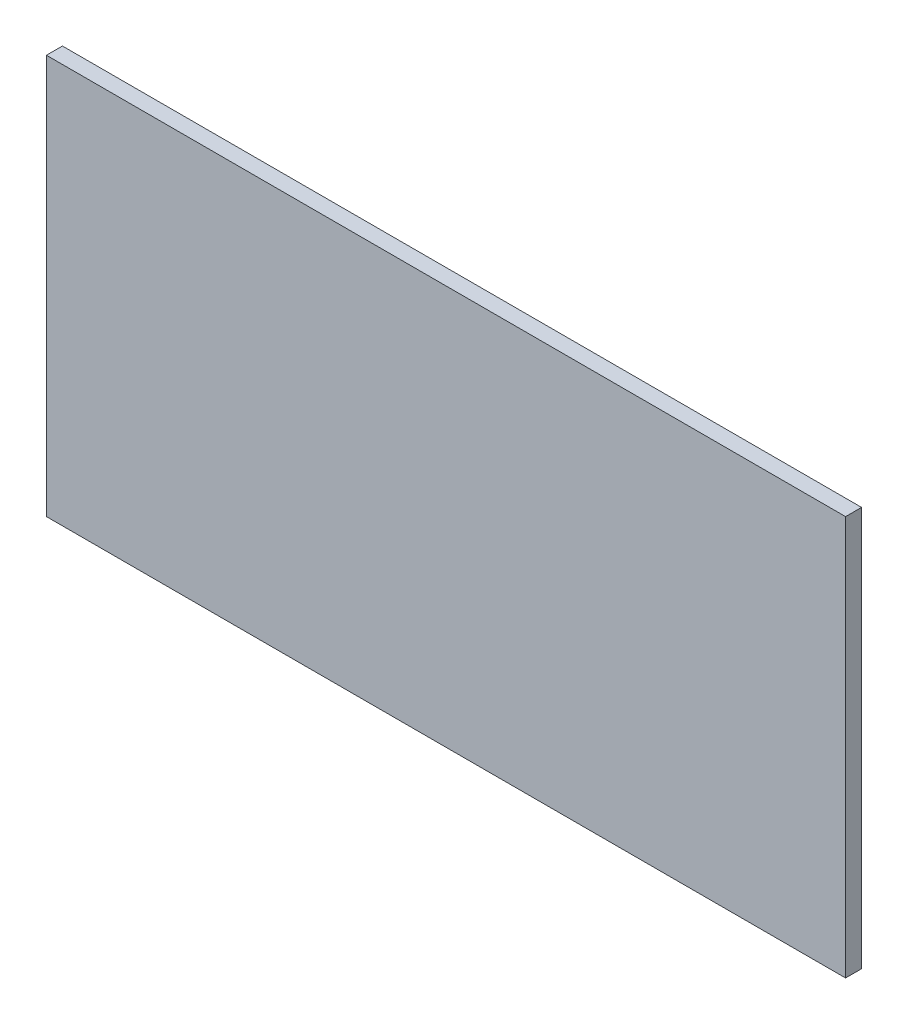
ISO-10303-21;
HEADER;
FILE_DESCRIPTION(('STEP AP214'),'2;1');
FILE_NAME('part.step','',(''),(''),'','','');
FILE_SCHEMA(('AUTOMOTIVE_DESIGN { 1 0 10303 214 1 1 1 1 }'));
ENDSEC;
DATA;
#1=APPLICATION_CONTEXT('core data for automotive mechanical design processes');
#2=APPLICATION_PROTOCOL_DEFINITION('international standard','automotive_design',2000,#1);
#3=PRODUCT_CONTEXT('',#1,'mechanical');
#4=PRODUCT('Part','Part','',(#3));
#5=PRODUCT_RELATED_PRODUCT_CATEGORY('part','',(#4));
#6=PRODUCT_DEFINITION_FORMATION('','',#4);
#7=PRODUCT_DEFINITION_CONTEXT('part definition',#1,'design');
#8=PRODUCT_DEFINITION('design','',#6,#7);
#9=PRODUCT_DEFINITION_SHAPE('','',#8);
#10=(LENGTH_UNIT() NAMED_UNIT(*) SI_UNIT(.MILLI.,.METRE.));
#11=(NAMED_UNIT(*) PLANE_ANGLE_UNIT() SI_UNIT($,.RADIAN.));
#12=(NAMED_UNIT(*) SI_UNIT($,.STERADIAN.) SOLID_ANGLE_UNIT());
#13=UNCERTAINTY_MEASURE_WITH_UNIT(LENGTH_MEASURE(1.E-05),#10,'distance_accuracy_value','');
#14=(GEOMETRIC_REPRESENTATION_CONTEXT(3) GLOBAL_UNCERTAINTY_ASSIGNED_CONTEXT((#13)) GLOBAL_UNIT_ASSIGNED_CONTEXT((#10,
#11,#12)) REPRESENTATION_CONTEXT('',''));
#15=CARTESIAN_POINT('',(0.,0.,0.));
#16=DIRECTION('',(0.,0.,1.));
#17=DIRECTION('',(1.,0.,0.));
#18=AXIS2_PLACEMENT_3D('',#15,#16,#17);
#19=CARTESIAN_POINT('',(-500.,250.,20.));
#20=DIRECTION('',(1.,0.,0.));
#21=DIRECTION('',(0.,0.,-1.));
#22=AXIS2_PLACEMENT_3D('',#19,#20,#21);
#23=PLANE('',#22);
#24=DIRECTION('',(0.,-1.,0.));
#25=VECTOR('',#24,1.);
#26=CARTESIAN_POINT('',(-500.,250.,0.));
#27=LINE('',#26,#25);
#28=CARTESIAN_POINT('',(-500.,250.,0.));
#29=VERTEX_POINT('',#28);
#30=CARTESIAN_POINT('',(-500.,-250.,0.));
#31=VERTEX_POINT('',#30);
#32=EDGE_CURVE('E94',#29,#31,#27,.T.);
#33=ORIENTED_EDGE('',*,*,#32,.T.);
#34=DIRECTION('',(0.,0.,-1.));
#35=VECTOR('',#34,1.);
#36=CARTESIAN_POINT('',(-500.,-250.,20.));
#37=LINE('',#36,#35);
#38=CARTESIAN_POINT('',(-500.,-250.,20.));
#39=VERTEX_POINT('',#38);
#40=EDGE_CURVE('E11',#39,#31,#37,.T.);
#41=ORIENTED_EDGE('',*,*,#40,.F.);
#42=DIRECTION('',(0.,-1.,0.));
#43=VECTOR('',#42,1.);
#44=CARTESIAN_POINT('',(-500.,250.,20.));
#45=LINE('',#44,#43);
#46=CARTESIAN_POINT('',(-500.,250.,20.));
#47=VERTEX_POINT('',#46);
#48=EDGE_CURVE('E82',#47,#39,#45,.T.);
#49=ORIENTED_EDGE('',*,*,#48,.F.);
#50=DIRECTION('',(0.,0.,-1.));
#51=VECTOR('',#50,1.);
#52=CARTESIAN_POINT('',(-500.,250.,20.));
#53=LINE('',#52,#51);
#54=EDGE_CURVE('E90',#47,#29,#53,.T.);
#55=ORIENTED_EDGE('',*,*,#54,.T.);
#56=EDGE_LOOP('',(#33,#41,#49,#55));
#57=FACE_BOUND('',#56,.T.);
#58=ADVANCED_FACE('F31',(#57),#23,.F.);
#59=CARTESIAN_POINT('',(-500.,-250.,20.));
#60=DIRECTION('',(0.,1.,0.));
#61=DIRECTION('',(0.,0.,1.));
#62=AXIS2_PLACEMENT_3D('',#59,#60,#61);
#63=PLANE('',#62);
#64=DIRECTION('',(1.,0.,0.));
#65=VECTOR('',#64,1.);
#66=CARTESIAN_POINT('',(-500.,-250.,0.));
#67=LINE('',#66,#65);
#68=CARTESIAN_POINT('',(500.,-250.,0.));
#69=VERTEX_POINT('',#68);
#70=EDGE_CURVE('E86',#31,#69,#67,.T.);
#71=ORIENTED_EDGE('',*,*,#70,.T.);
#72=DIRECTION('',(0.,0.,-1.));
#73=VECTOR('',#72,1.);
#74=CARTESIAN_POINT('',(500.,-250.,20.));
#75=LINE('',#74,#73);
#76=CARTESIAN_POINT('',(500.,-250.,20.));
#77=VERTEX_POINT('',#76);
#78=EDGE_CURVE('E39',#77,#69,#75,.T.);
#79=ORIENTED_EDGE('',*,*,#78,.F.);
#80=DIRECTION('',(1.,0.,0.));
#81=VECTOR('',#80,1.);
#82=CARTESIAN_POINT('',(-500.,-250.,20.));
#83=LINE('',#82,#81);
#84=EDGE_CURVE('E77',#39,#77,#83,.T.);
#85=ORIENTED_EDGE('',*,*,#84,.F.);
#86=ORIENTED_EDGE('',*,*,#40,.T.);
#87=EDGE_LOOP('',(#71,#79,#85,#86));
#88=FACE_BOUND('',#87,.T.);
#89=ADVANCED_FACE('F85',(#88),#63,.F.);
#90=CARTESIAN_POINT('',(500.,250.,20.));
#91=DIRECTION('',(-1.,0.,0.));
#92=DIRECTION('',(0.,0.,1.));
#93=AXIS2_PLACEMENT_3D('',#90,#91,#92);
#94=PLANE('',#93);
#95=DIRECTION('',(0.,1.,0.));
#96=VECTOR('',#95,1.);
#97=CARTESIAN_POINT('',(500.,250.,0.));
#98=LINE('',#97,#96);
#99=CARTESIAN_POINT('',(500.,250.,0.));
#100=VERTEX_POINT('',#99);
#101=EDGE_CURVE('E64',#69,#100,#98,.T.);
#102=ORIENTED_EDGE('',*,*,#101,.T.);
#103=DIRECTION('',(0.,0.,-1.));
#104=VECTOR('',#103,1.);
#105=CARTESIAN_POINT('',(500.,250.,20.));
#106=LINE('',#105,#104);
#107=CARTESIAN_POINT('',(500.,250.,20.));
#108=VERTEX_POINT('',#107);
#109=EDGE_CURVE('E87',#108,#100,#106,.T.);
#110=ORIENTED_EDGE('',*,*,#109,.F.);
#111=DIRECTION('',(0.,1.,0.));
#112=VECTOR('',#111,1.);
#113=CARTESIAN_POINT('',(500.,250.,20.));
#114=LINE('',#113,#112);
#115=EDGE_CURVE('E80',#77,#108,#114,.T.);
#116=ORIENTED_EDGE('',*,*,#115,.F.);
#117=ORIENTED_EDGE('',*,*,#78,.T.);
#118=EDGE_LOOP('',(#102,#110,#116,#117));
#119=FACE_BOUND('',#118,.T.);
#120=ADVANCED_FACE('F88',(#119),#94,.F.);
#121=CARTESIAN_POINT('',(-500.,250.,20.));
#122=DIRECTION('',(0.,-1.,0.));
#123=DIRECTION('',(0.,0.,-1.));
#124=AXIS2_PLACEMENT_3D('',#121,#122,#123);
#125=PLANE('',#124);
#126=DIRECTION('',(-1.,0.,0.));
#127=VECTOR('',#126,1.);
#128=CARTESIAN_POINT('',(-500.,250.,0.));
#129=LINE('',#128,#127);
#130=EDGE_CURVE('E70',#100,#29,#129,.T.);
#131=ORIENTED_EDGE('',*,*,#130,.T.);
#132=ORIENTED_EDGE('',*,*,#54,.F.);
#133=DIRECTION('',(-1.,0.,0.));
#134=VECTOR('',#133,1.);
#135=CARTESIAN_POINT('',(-500.,250.,20.));
#136=LINE('',#135,#134);
#137=EDGE_CURVE('E47',#108,#47,#136,.T.);
#138=ORIENTED_EDGE('',*,*,#137,.F.);
#139=ORIENTED_EDGE('',*,*,#109,.T.);
#140=EDGE_LOOP('',(#131,#132,#138,#139));
#141=FACE_BOUND('',#140,.T.);
#142=ADVANCED_FACE('F101',(#141),#125,.F.);
#143=CARTESIAN_POINT('',(0.,0.,20.));
#144=DIRECTION('',(0.,0.,1.));
#145=DIRECTION('',(1.,0.,0.));
#146=AXIS2_PLACEMENT_3D('',#143,#144,#145);
#147=PLANE('',#146);
#148=ORIENTED_EDGE('',*,*,#48,.T.);
#149=ORIENTED_EDGE('',*,*,#84,.T.);
#150=ORIENTED_EDGE('',*,*,#115,.T.);
#151=ORIENTED_EDGE('',*,*,#137,.T.);
#152=EDGE_LOOP('',(#148,#149,#150,#151));
#153=FACE_BOUND('',#152,.T.);
#154=ADVANCED_FACE('F78',(#153),#147,.T.);
#155=CARTESIAN_POINT('',(0.,0.,0.));
#156=DIRECTION('',(0.,0.,1.));
#157=DIRECTION('',(1.,0.,0.));
#158=AXIS2_PLACEMENT_3D('',#155,#156,#157);
#159=PLANE('',#158);
#160=ORIENTED_EDGE('',*,*,#32,.F.);
#161=ORIENTED_EDGE('',*,*,#130,.F.);
#162=ORIENTED_EDGE('',*,*,#101,.F.);
#163=ORIENTED_EDGE('',*,*,#70,.F.);
#164=EDGE_LOOP('',(#160,#161,#162,#163));
#165=FACE_BOUND('',#164,.T.);
#166=ADVANCED_FACE('F104',(#165),#159,.F.);
#167=CLOSED_SHELL('',(#58,#89,#120,#142,#154,#166));
#168=MANIFOLD_SOLID_BREP('B2',#167);
#169=ADVANCED_BREP_SHAPE_REPRESENTATION('',(#18,#168),#14);
#170=SHAPE_DEFINITION_REPRESENTATION(#9,#169);
ENDSEC;
END-ISO-10303-21;
